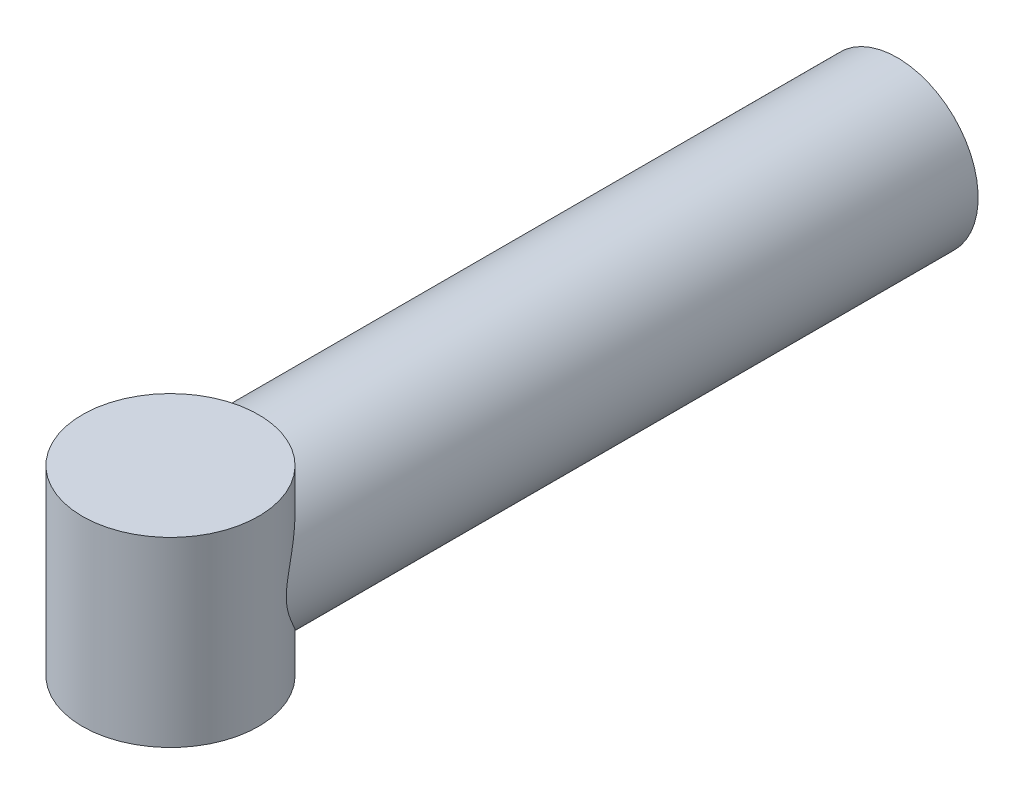
ISO-10303-21;
HEADER;
FILE_DESCRIPTION(('STEP AP214'),'2;1');
FILE_NAME('part.step','',(''),(''),'','','');
FILE_SCHEMA(('AUTOMOTIVE_DESIGN { 1 0 10303 214 1 1 1 1 }'));
ENDSEC;
DATA;
#1=APPLICATION_CONTEXT('core data for automotive mechanical design processes');
#2=APPLICATION_PROTOCOL_DEFINITION('international standard','automotive_design',2000,#1);
#3=PRODUCT_CONTEXT('',#1,'mechanical');
#4=PRODUCT('Part','Part','',(#3));
#5=PRODUCT_RELATED_PRODUCT_CATEGORY('part','',(#4));
#6=PRODUCT_DEFINITION_FORMATION('','',#4);
#7=PRODUCT_DEFINITION_CONTEXT('part definition',#1,'design');
#8=PRODUCT_DEFINITION('design','',#6,#7);
#9=PRODUCT_DEFINITION_SHAPE('','',#8);
#10=(LENGTH_UNIT() NAMED_UNIT(*) SI_UNIT(.MILLI.,.METRE.));
#11=(NAMED_UNIT(*) PLANE_ANGLE_UNIT() SI_UNIT($,.RADIAN.));
#12=(NAMED_UNIT(*) SI_UNIT($,.STERADIAN.) SOLID_ANGLE_UNIT());
#13=UNCERTAINTY_MEASURE_WITH_UNIT(LENGTH_MEASURE(1.E-05),#10,'distance_accuracy_value','');
#14=(GEOMETRIC_REPRESENTATION_CONTEXT(3) GLOBAL_UNCERTAINTY_ASSIGNED_CONTEXT((#13)) GLOBAL_UNIT_ASSIGNED_CONTEXT((#10,
#11,#12)) REPRESENTATION_CONTEXT('',''));
#15=CARTESIAN_POINT('',(0.,0.,0.));
#16=DIRECTION('',(0.,0.,1.));
#17=DIRECTION('',(1.,0.,0.));
#18=AXIS2_PLACEMENT_3D('',#15,#16,#17);
#19=CARTESIAN_POINT('',(0.,22.5,79.7384381673112));
#20=DIRECTION('',(0.,-1.,0.));
#21=DIRECTION('',(0.,0.,-1.));
#22=AXIS2_PLACEMENT_3D('',#19,#20,#21);
#23=CYLINDRICAL_SURFACE('',#22,21.7897785141328);
#24=CARTESIAN_POINT('',(0.,22.5,79.7384381673112));
#25=DIRECTION('',(0.,1.,0.));
#26=DIRECTION('',(0.,0.,1.));
#27=AXIS2_PLACEMENT_3D('',#24,#25,#26);
#28=CIRCLE('',#27,21.7897785141328);
#29=CARTESIAN_POINT('',(0.,22.5,101.528216681444));
#30=VERTEX_POINT('',#29);
#31=EDGE_CURVE('E92',#30,#30,#28,.T.);
#32=ORIENTED_EDGE('',*,*,#31,.F.);
#33=EDGE_LOOP('',(#32));
#34=FACE_BOUND('',#33,.T.);
#35=CARTESIAN_POINT('',(0.,-22.5,79.7384381673112));
#36=DIRECTION('',(0.,1.,0.));
#37=DIRECTION('',(0.,0.,1.));
#38=AXIS2_PLACEMENT_3D('',#35,#36,#37);
#39=CIRCLE('',#38,21.7897785141328);
#40=CARTESIAN_POINT('',(0.,-22.5,101.528216681444));
#41=VERTEX_POINT('',#40);
#42=EDGE_CURVE('E58',#41,#41,#39,.T.);
#43=ORIENTED_EDGE('',*,*,#42,.T.);
#44=EDGE_LOOP('',(#43));
#45=FACE_BOUND('',#44,.T.);
#46=CARTESIAN_POINT('',(-20.,0.,71.0900598398464));
#47=CARTESIAN_POINT('',(-20.0000003572792,-0.28248635995844,71.0900611760895));
#48=CARTESIAN_POINT('',(-19.9939947332945,-0.564967834462663,71.0761325087891));
#49=CARTESIAN_POINT('',(-19.9702133636225,-1.12679786874057,71.0214497676802));
#50=CARTESIAN_POINT('',(-19.9524362772046,-1.40614606795849,70.9806926382015));
#51=CARTESIAN_POINT('',(-19.9056454359633,-1.96035418023474,70.8748581883427));
#52=CARTESIAN_POINT('',(-19.8765852636115,-2.23519059963312,70.8096804431835));
#53=CARTESIAN_POINT('',(-19.8080374855605,-2.77786409045319,70.6586282622042));
#54=CARTESIAN_POINT('',(-19.7685440046747,-3.0456971244569,70.5727421675208));
#55=CARTESIAN_POINT('',(-19.6907617627878,-3.50925755055089,70.4070633814724));
#56=CARTESIAN_POINT('',(-19.6545254750975,-3.70664875964659,70.3308875822483));
#57=CARTESIAN_POINT('',(-19.5768885065106,-4.09695021890429,70.1703741962422));
#58=CARTESIAN_POINT('',(-19.5354895131355,-4.28986190894655,70.0860392784224));
#59=CARTESIAN_POINT('',(-19.4038760259827,-4.86242358702407,69.8226720285174));
#60=CARTESIAN_POINT('',(-19.3062837266498,-5.23567351611419,69.6333614371278));
#61=CARTESIAN_POINT('',(-19.0927621259315,-5.96759739242854,69.2354807974977));
#62=CARTESIAN_POINT('',(-18.9767787807289,-6.32622433661935,69.0268547654054));
#63=CARTESIAN_POINT('',(-18.7276432043651,-7.02954455884812,68.5970045337474));
#64=CARTESIAN_POINT('',(-18.594493853971,-7.37424016209786,68.3757824514976));
#65=CARTESIAN_POINT('',(-18.3241788616531,-8.02097612211901,67.9453182071517));
#66=CARTESIAN_POINT('',(-18.1884326031341,-8.32407754792096,67.7367693122606));
#67=CARTESIAN_POINT('',(-17.9033013564316,-8.92082720114438,67.3154364902626));
#68=CARTESIAN_POINT('',(-17.7539145700074,-9.21447417525667,67.102652007675));
#69=CARTESIAN_POINT('',(-17.4414881495564,-9.79298823916839,66.6747803988144));
#70=CARTESIAN_POINT('',(-17.2784409139607,-10.0778503182388,66.459692049358));
#71=CARTESIAN_POINT('',(-16.9387299103715,-10.6389356480963,66.0289829451423));
#72=CARTESIAN_POINT('',(-16.7620648522505,-10.9151580768854,65.8133621418169));
#73=CARTESIAN_POINT('',(-16.2119545434275,-11.730403788404,65.1684068786787));
#74=CARTESIAN_POINT('',(-15.8179607238608,-12.2568078143143,64.7403770732155));
#75=CARTESIAN_POINT('',(-14.9743114436707,-13.2742707988032,63.8979881856978));
#76=CARTESIAN_POINT('',(-14.5246860889363,-13.7653486491174,63.4836218618771));
#77=CARTESIAN_POINT('',(-13.6891202854943,-14.5897210158038,62.779043335664));
#78=CARTESIAN_POINT('',(-13.3157496671708,-14.9315554610108,62.4838922460962));
#79=CARTESIAN_POINT('',(-12.5367283975626,-15.5913765395692,61.9098375834796));
#80=CARTESIAN_POINT('',(-12.1310780668647,-15.9093634097024,61.6309338491174));
#81=CARTESIAN_POINT('',(-11.2879832649086,-16.5182107715538,61.0937267978679));
#82=CARTESIAN_POINT('',(-10.8505849964875,-16.8091093303085,60.8353946481816));
#83=CARTESIAN_POINT('',(-10.1709008734813,-17.2227501543266,60.4663414288393));
#84=CARTESIAN_POINT('',(-9.94042099926592,-17.3568395330614,60.3464036239859));
#85=CARTESIAN_POINT('',(-9.47162764837507,-17.6170416828864,60.1131668312528));
#86=CARTESIAN_POINT('',(-9.23331218491498,-17.7431524068401,59.9998695477199));
#87=CARTESIAN_POINT('',(-8.60475970769942,-18.0594905657577,59.7151402957496));
#88=CARTESIAN_POINT('',(-8.20861970868929,-18.2431423245337,59.5492985400035));
#89=CARTESIAN_POINT('',(-7.39828948240311,-18.5865248679967,59.2384861816186));
#90=CARTESIAN_POINT('',(-6.98410325143047,-18.7462609143627,59.0935109884143));
#91=CARTESIAN_POINT('',(-6.13942475905216,-19.0396228607865,58.8267677546328));
#92=CARTESIAN_POINT('',(-5.70893763283468,-19.1732569032616,58.7049924772261));
#93=CARTESIAN_POINT('',(-4.83387999030584,-19.4123491767946,58.4868180853634));
#94=CARTESIAN_POINT('',(-4.38930932145478,-19.5178071025585,58.3904192458666));
#95=CARTESIAN_POINT('',(-3.48603665147611,-19.6992674283498,58.2243908126248));
#96=CARTESIAN_POINT('',(-3.02725987452898,-19.7750675433687,58.1549450810515));
#97=CARTESIAN_POINT('',(-2.1020717635314,-19.8946936979974,58.0452891966034));
#98=CARTESIAN_POINT('',(-1.63566040870281,-19.9385196505719,58.0050791233094));
#99=CARTESIAN_POINT('',(-0.699442626089152,-19.9932633538939,57.9548455175677));
#100=CARTESIAN_POINT('',(-0.22963741167008,-20.0041923337382,57.9448116847228));
#101=CARTESIAN_POINT('',(0.709216063219477,-19.9929326169856,57.9551465038911));
#102=CARTESIAN_POINT('',(1.17826438185688,-19.9707465997382,57.9755126962244));
#103=CARTESIAN_POINT('',(2.0616027684016,-19.8978591879361,58.0423770654607));
#104=CARTESIAN_POINT('',(2.47640125457342,-19.8504487278428,58.0858589808239));
#105=CARTESIAN_POINT('',(3.29918613292553,-19.7303874221606,58.1958743269091));
#106=CARTESIAN_POINT('',(3.70717311084469,-19.6577387587078,58.2624057647306));
#107=CARTESIAN_POINT('',(4.51387812578193,-19.4883251122128,58.4173666096859));
#108=CARTESIAN_POINT('',(4.91259539190978,-19.3915581312242,58.5057978309803));
#109=CARTESIAN_POINT('',(5.69862480994007,-19.1752929955066,58.7031261447758));
#110=CARTESIAN_POINT('',(6.08593629004327,-19.0557935049159,58.8120244400071));
#111=CARTESIAN_POINT('',(6.86427751615628,-18.789844023563,59.0539150526225));
#112=CARTESIAN_POINT('',(7.25471359705718,-18.6424355580195,59.1877602148464));
#113=CARTESIAN_POINT('',(8.0197688429527,-18.3263375645778,59.4740701566773));
#114=CARTESIAN_POINT('',(8.39438800957018,-18.1576480388632,59.6265349343738));
#115=CARTESIAN_POINT('',(9.12684589740211,-17.8007496226652,59.9481590894689));
#116=CARTESIAN_POINT('',(9.48468144652722,-17.6125370637604,60.1173216041194));
#117=CARTESIAN_POINT('',(10.182866165579,-17.2183051734186,60.4704127788643));
#118=CARTESIAN_POINT('',(10.5232115852937,-17.0122820482529,60.6543445842856));
#119=CARTESIAN_POINT('',(11.3603997917174,-16.4713053061508,61.1353230142865));
#120=CARTESIAN_POINT('',(11.8453793759681,-16.1255426177975,61.4409723721199));
#121=CARTESIAN_POINT('',(12.773265036337,-15.4009914058984,62.0762023746111));
#122=CARTESIAN_POINT('',(13.2161519258357,-15.0221879712133,62.4057938128865));
#123=CARTESIAN_POINT('',(14.0612795385175,-14.2342939673675,63.0840331419917));
#124=CARTESIAN_POINT('',(14.4634009939412,-13.8251202682369,63.4327325984902));
#125=CARTESIAN_POINT('',(15.2262138066704,-12.9802294400468,64.1426615789099));
#126=CARTESIAN_POINT('',(15.5869129010945,-12.5445172913437,64.5038887463641));
#127=CARTESIAN_POINT('',(16.2762300953977,-11.6368870600109,65.2422280887121));
#128=CARTESIAN_POINT('',(16.6038326994043,-11.1643396230547,65.6195121216801));
#129=CARTESIAN_POINT('',(17.217367306302,-10.1927769991871,66.3745655799328));
#130=CARTESIAN_POINT('',(17.5032811361513,-9.69375039794832,66.7523351449128));
#131=CARTESIAN_POINT('',(17.9004857988479,-8.92498601079619,67.31187902848));
#132=CARTESIAN_POINT('',(18.0274779037477,-8.66567956837124,67.496993481501));
#133=CARTESIAN_POINT('',(18.2710064369723,-8.139677748946,67.8635434673288));
#134=CARTESIAN_POINT('',(18.3875440604192,-7.87298322110109,68.0449794188097));
#135=CARTESIAN_POINT('',(18.6099370782173,-7.33183145867082,68.402259919214));
#136=CARTESIAN_POINT('',(18.7158005929675,-7.05738033161961,68.5781086478247));
#137=CARTESIAN_POINT('',(18.9166591827064,-6.49983071063637,68.9220581501028));
#138=CARTESIAN_POINT('',(19.0116567029901,-6.2167341805159,69.0901606618822));
#139=CARTESIAN_POINT('',(19.1772978028237,-5.68308524466734,69.3919002304823));
#140=CARTESIAN_POINT('',(19.2494712615338,-5.43382809000155,69.5269824044619));
#141=CARTESIAN_POINT('',(19.3851943502404,-4.92776508253637,69.7870468129796));
#142=CARTESIAN_POINT('',(19.4487440979395,-4.67095933282386,69.9120291853577));
#143=CARTESIAN_POINT('',(19.5666038958633,-4.14962007147203,70.1488637407674));
#144=CARTESIAN_POINT('',(19.6209246713158,-3.88509595448173,70.2607311175386));
#145=CARTESIAN_POINT('',(19.7196999801292,-3.34783236365247,70.4679974996239));
#146=CARTESIAN_POINT('',(19.7641563150871,-3.07509440030461,70.5633995113901));
#147=CARTESIAN_POINT('',(19.835543689033,-2.56991465698943,70.7189224476781));
#148=CARTESIAN_POINT('',(19.8641782197508,-2.33872009183261,70.782293940923));
#149=CARTESIAN_POINT('',(19.91361222915,-1.8716702733388,70.8927516503787));
#150=CARTESIAN_POINT('',(19.9344141773357,-1.63581651370543,70.9398429991088));
#151=CARTESIAN_POINT('',(19.9676888311595,-1.1609987762512,71.0156188315472));
#152=CARTESIAN_POINT('',(19.9801769000767,-0.922041371792785,71.0443372628492));
#153=CARTESIAN_POINT('',(19.9965496539802,-0.442265787116113,71.0820599746344));
#154=CARTESIAN_POINT('',(20.0004346514609,-0.201447674804308,71.0910649711802));
#155=CARTESIAN_POINT('',(19.9994868890063,0.280675900510312,71.0888732663462));
#156=CARTESIAN_POINT('',(19.9946324871611,0.521981091178815,71.0776264140584));
#157=CARTESIAN_POINT('',(19.9763059050874,1.00251359399952,71.0354405772472));
#158=CARTESIAN_POINT('',(19.9628333922811,1.24174082560094,71.0045008327638));
#159=CARTESIAN_POINT('',(19.9275962101371,1.71691197309894,70.9244007797162));
#160=CARTESIAN_POINT('',(19.9058165438277,1.95284914619686,70.8752075223255));
#161=CARTESIAN_POINT('',(19.8544476126255,2.41995250095189,70.7607275529592));
#162=CARTESIAN_POINT('',(19.8248552400749,2.65111674454339,70.6954344376318));
#163=CARTESIAN_POINT('',(19.7389528416094,3.241529531484,70.5089218431146));
#164=CARTESIAN_POINT('',(19.6771344800041,3.59670107341507,70.3773154639281));
#165=CARTESIAN_POINT('',(19.5370469769259,4.29303738735554,70.0883598687633));
#166=CARTESIAN_POINT('',(19.4587659314387,4.63419180916719,69.9309920432674));
#167=CARTESIAN_POINT('',(19.2868375591216,5.30453102851535,69.5970497005369));
#168=CARTESIAN_POINT('',(19.1931332729075,5.63366571286817,69.4204048386497));
#169=CARTESIAN_POINT('',(18.9915317392251,6.27982906877321,69.0538728785239));
#170=CARTESIAN_POINT('',(18.8836366240762,6.59685954989148,68.8639877717798));
#171=CARTESIAN_POINT('',(18.6567744814889,7.21319436939717,68.4793089028174));
#172=CARTESIAN_POINT('',(18.5381058524331,7.51273585053304,68.2847172139081));
#173=CARTESIAN_POINT('',(18.2880490085117,8.1024592546616,67.8895389036377));
#174=CARTESIAN_POINT('',(18.1566586541723,8.39263959236797,67.6889512778459));
#175=CARTESIAN_POINT('',(17.8812449450892,8.96447722482946,67.2838989594852));
#176=CARTESIAN_POINT('',(17.7372135928139,9.24612897007442,67.079431877564));
#177=CARTESIAN_POINT('',(17.4366330883591,9.80119392963664,66.6685054884422));
#178=CARTESIAN_POINT('',(17.2800826489563,10.0746062927839,66.4620459783025));
#179=CARTESIAN_POINT('',(16.7917573383597,10.882707127326,65.8421178406379));
#180=CARTESIAN_POINT('',(16.4411515991456,11.4055843065955,65.4278652863788));
#181=CARTESIAN_POINT('',(15.6892206203267,12.4195952593169,64.6072554692453));
#182=CARTESIAN_POINT('',(15.2879199372172,12.910744228893,64.200894492935));
#183=CARTESIAN_POINT('',(14.5078388719998,13.7768037286288,63.4734518695891));
#184=CARTESIAN_POINT('',(14.13733066117,14.1570505792372,63.14985424267));
#185=CARTESIAN_POINT('',(13.3602314126824,14.892632379426,62.5178240715015));
#186=CARTESIAN_POINT('',(12.9536384316519,15.2479659854376,62.209392345415));
#187=CARTESIAN_POINT('',(12.1046768836881,15.930244914601,61.6127700580446));
#188=CARTESIAN_POINT('',(11.6623703386561,16.2572374916575,61.3245459635045));
#189=CARTESIAN_POINT('',(10.9720303193811,16.7239857301829,60.9107725089728));
#190=CARTESIAN_POINT('',(10.7374554735786,16.8756012652948,60.775951183973));
#191=CARTESIAN_POINT('',(10.2593245829736,17.1704737986945,60.5130603499061));
#192=CARTESIAN_POINT('',(10.0157663139267,17.3137287039564,60.3849925323003));
#193=CARTESIAN_POINT('',(9.38524365377179,17.6666167662132,60.0687978769084));
#194=CARTESIAN_POINT('',(8.99219360998417,17.8700761405912,59.8858007069753));
#195=CARTESIAN_POINT('',(8.186235509903,18.2533452503572,59.5401160415693));
#196=CARTESIAN_POINT('',(7.77333215133454,18.4331605432046,59.3774237739584));
#197=CARTESIAN_POINT('',(6.92913060676511,18.7668070500378,59.0748821213027));
#198=CARTESIAN_POINT('',(6.49783715271052,18.9206448983334,58.935026904267));
#199=CARTESIAN_POINT('',(5.61886605752035,19.2000253910914,58.6806108665613));
#200=CARTESIAN_POINT('',(5.17118820030012,19.325567662223,58.5660503796294));
#201=CARTESIAN_POINT('',(4.25868703321097,19.5470122082805,58.3637313842014));
#202=CARTESIAN_POINT('',(3.79375684931506,19.6426744812833,58.2761899613456));
#203=CARTESIAN_POINT('',(2.85367547428726,19.8011037797231,58.1310980970539));
#204=CARTESIAN_POINT('',(2.37852425422598,19.8638707120411,58.0735477405157));
#205=CARTESIAN_POINT('',(1.4224353310332,19.9551286011376,57.9898456990057));
#206=CARTESIAN_POINT('',(0.941500821485025,19.9836376699871,57.9636774223992));
#207=CARTESIAN_POINT('',(-0.0218212092103692,20.005788300199,57.9433471772745));
#208=CARTESIAN_POINT('',(-0.504208568186972,19.9994336187627,57.9491817598677));
#209=CARTESIAN_POINT('',(-1.40709908668984,19.9549193279786,57.9900314933659));
#210=CARTESIAN_POINT('',(-1.82797388316128,19.9207335357678,58.0214006603827));
#211=CARTESIAN_POINT('',(-2.66424332886874,19.8262158380741,58.1080677320468));
#212=CARTESIAN_POINT('',(-3.07963851330049,19.7658865058179,58.1633632816945));
#213=CARTESIAN_POINT('',(-3.90223646601112,19.620068120257,58.2968742652014));
#214=CARTESIAN_POINT('',(-4.30943885313428,19.5345778992638,58.3750907627953));
#215=CARTESIAN_POINT('',(-5.11326928763226,19.3397397320065,58.5531033116574));
#216=CARTESIAN_POINT('',(-5.5098967741772,19.2303905232165,58.6529005048905));
#217=CARTESIAN_POINT('',(-6.29852849405549,18.98689826423,58.8747332619868));
#218=CARTESIAN_POINT('',(-6.69027482841141,18.8522963712543,58.9971796660797));
#219=CARTESIAN_POINT('',(-7.45904300774888,18.5615620874849,59.2610771434985));
#220=CARTESIAN_POINT('',(-7.83606510566264,18.4054300667435,59.4025278901832));
#221=CARTESIAN_POINT('',(-8.57429760167227,18.0733308207,59.7026035402509));
#222=CARTESIAN_POINT('',(-8.93550394705475,17.8973585522466,59.8612328098002));
#223=CARTESIAN_POINT('',(-9.641232095497,17.5272780447933,60.1937883069976));
#224=CARTESIAN_POINT('',(-9.98575033965209,17.3331659629257,60.3677177754892));
#225=CARTESIAN_POINT('',(-10.8262977303207,16.8267141025745,60.819825061821));
#226=CARTESIAN_POINT('',(-11.3115366040743,16.503952388982,61.1064942120083));
#227=CARTESIAN_POINT('',(-12.2424452562332,15.8257543642277,61.7044888496532));
#228=CARTESIAN_POINT('',(-12.6880979931938,15.4703041137017,62.0158248478785));
#229=CARTESIAN_POINT('',(-13.5407693430654,14.729803830266,62.6584034521194));
#230=CARTESIAN_POINT('',(-13.9476997342337,14.3446896599089,62.9896888339062));
#231=CARTESIAN_POINT('',(-14.7222974190903,13.5485221167601,63.6663244098141));
#232=CARTESIAN_POINT('',(-15.0899704020456,13.1374725163599,64.0116725558814));
#233=CARTESIAN_POINT('',(-15.7951426190903,12.2812207042018,64.7196721216929));
#234=CARTESIAN_POINT('',(-16.1317210162458,11.8354402044192,65.0825396346472));
#235=CARTESIAN_POINT('',(-16.765420585543,10.9192972032391,65.811896894606));
#236=CARTESIAN_POINT('',(-17.0625315490443,10.448928385504,66.1783875525367));
#237=CARTESIAN_POINT('',(-17.6172638797565,9.48375304714811,66.9073997274666));
#238=CARTESIAN_POINT('',(-17.8749453566086,8.98898527631192,67.269926487795));
#239=CARTESIAN_POINT('',(-18.2319738499236,8.22640259138612,67.8038007391237));
#240=CARTESIAN_POINT('',(-18.3460519270311,7.96884578037025,67.9800789253475));
#241=CARTESIAN_POINT('',(-18.5642735484756,7.44633742606715,68.3277304426973));
#242=CARTESIAN_POINT('',(-18.6684183744524,7.18138684248035,68.4991044045892));
#243=CARTESIAN_POINT('',(-18.8689020499327,6.63706536769014,68.838951110321));
#244=CARTESIAN_POINT('',(-18.9649979819889,6.35750162080035,69.0072593390071));
#245=CARTESIAN_POINT('',(-19.1461392083139,5.78915314843404,69.3338886451562));
#246=CARTESIAN_POINT('',(-19.2311870838856,5.50037059658231,69.4922120510409));
#247=CARTESIAN_POINT('',(-19.3896570858591,4.91262107808144,69.7953555684276));
#248=CARTESIAN_POINT('',(-19.4630789026105,4.6136538404292,69.9401753202286));
#249=CARTESIAN_POINT('',(-19.5974170804695,4.0047946039629,70.2117056863148));
#250=CARTESIAN_POINT('',(-19.6583352928504,3.69490423039188,70.3384189805817));
#251=CARTESIAN_POINT('',(-19.7585521354798,3.1103293068833,70.5511737944867));
#252=CARTESIAN_POINT('',(-19.7997117336784,2.83715498387932,70.6404552430335));
#253=CARTESIAN_POINT('',(-19.8711863892135,2.28337645299683,70.7976397322475));
#254=CARTESIAN_POINT('',(-19.9015068985801,2.00277605691477,70.8655535187199));
#255=CARTESIAN_POINT('',(-19.9503360214293,1.43679047119892,70.9758923891488));
#256=CARTESIAN_POINT('',(-19.9688959543561,1.15143172568808,71.0184281665216));
#257=CARTESIAN_POINT('',(-19.9937267120661,0.577379900876563,71.0755088197463));
#258=CARTESIAN_POINT('',(-19.999999634878,0.288687399290344,71.0900584742706));
#259=CARTESIAN_POINT('',(-20.,0.,71.0900598398464));
#260=B_SPLINE_CURVE_WITH_KNOTS('',3,(#46,#47,#48,#49,#50,#51,#52,#53,#54,#55,#56,#57,#58,#59,
#60,#61,#62,#63,#64,#65,#66,#67,#68,#69,#70,#71,#72,#73,#74,#75,#76,#77,#78,#79,#80,#81,#82,#83,
#84,#85,#86,#87,#88,#89,#90,#91,#92,#93,#94,#95,#96,#97,#98,#99,#100,#101,#102,#103,#104,#105,
#106,#107,#108,#109,#110,#111,#112,#113,#114,#115,#116,#117,#118,#119,#120,#121,#122,#123,#124,
#125,#126,#127,#128,#129,#130,#131,#132,#133,#134,#135,#136,#137,#138,#139,#140,#141,#142,#143,
#144,#145,#146,#147,#148,#149,#150,#151,#152,#153,#154,#155,#156,#157,#158,#159,#160,#161,#162,
#163,#164,#165,#166,#167,#168,#169,#170,#171,#172,#173,#174,#175,#176,#177,#178,#179,#180,#181,
#182,#183,#184,#185,#186,#187,#188,#189,#190,#191,#192,#193,#194,#195,#196,#197,#198,#199,#200,
#201,#202,#203,#204,#205,#206,#207,#208,#209,#210,#211,#212,#213,#214,#215,#216,#217,#218,#219,
#220,#221,#222,#223,#224,#225,#226,#227,#228,#229,#230,#231,#232,#233,#234,#235,#236,#237,#238,
#239,#240,#241,#242,#243,#244,#245,#246,#247,#248,#249,#250,#251,#252,#253,#254,#255,#256,#257,
#258,#259),.UNSPECIFIED.,.T.,.F.,(4,2,2,2,2,2,2,2,2,2,2,2,2,2,2,2,2,2,2,2,2,2,2,2,2,2,2,2,2,2,2,
2,2,2,2,2,2,2,2,2,2,2,2,2,2,2,2,2,2,2,2,2,2,2,2,2,2,2,2,2,2,2,2,2,2,2,2,2,2,2,2,2,2,2,2,2,2,2,2,
2,2,2,2,2,2,2,2,2,2,2,2,2,2,2,2,2,2,2,2,2,2,2,2,2,2,2,4),(0.,0.847061951426545,1.69422039700871,
2.54490154196973,3.39606274591446,4.03976964706402,4.68326669006242,5.97099261850597,
7.26257527894536,8.55394146984323,9.73003835955019,10.9062905194306,12.0832016266586,
13.2602243696371,15.611000827189,17.9605106437044,19.7170016540209,21.4734752218796,
23.2274419522324,24.1043339654017,24.9814500636822,26.3812529618232,27.7807474363319,
29.1798046443653,30.5788770108573,31.9873321804388,33.395791183888,34.8037693675039,
36.2116336371393,37.4694584047576,38.7271744458596,39.9849947100211,41.2428889120458,
42.5564374522148,43.8699858576101,45.1837815303204,46.4978577400449,48.5032384839807,
50.5095289766565,52.5215294423595,54.5331534811019,56.5945869875509,58.6569164481209,
59.6856467510954,60.7142593027346,61.7420833309049,62.7696755994726,63.6469894527702,
64.5242913306506,65.4005665940428,66.2766816864855,67.0003313221939,67.7237526098081,
68.445833343568,69.1678878483334,69.891732881106,70.6156058491646,71.3407918641609,
72.0662667719239,73.2156146290938,74.3657964443101,75.520325429202,76.6746811318953,
77.8034518542551,78.9324127382224,80.06209309852,81.1918897632304,83.4501959465387,
85.7074123771041,87.5710854550738,89.4348589635513,91.2954626350188,92.2256255060946,
93.1560202469021,94.5913961068917,96.0264339813782,97.4611048092916,98.8957945650927,
100.341728104621,101.787665737227,103.232838568379,104.677855659011,105.94662256329,
107.215264615173,108.483965552592,109.75273364107,111.047294474389,112.341833060014,
113.636701446737,114.931844772185,116.877341685308,118.823672097468,120.774335709062,
122.724716241543,124.721288044638,126.718375279247,128.712386984433,129.709075836354,
130.705635915846,131.725768989794,132.745663286277,133.765584742237,134.785355080368,
135.655418929428,136.525044521076,137.390848723369,138.25650507517),.UNSPECIFIED.);
#261=CARTESIAN_POINT('',(-20.,0.,71.0900598398464));
#262=VERTEX_POINT('',#261);
#263=EDGE_CURVE('E10',#262,#262,#260,.T.);
#264=ORIENTED_EDGE('',*,*,#263,.T.);
#265=EDGE_LOOP('',(#264));
#266=FACE_BOUND('',#265,.T.);
#267=ADVANCED_FACE('F34',(#34,#45,#266),#23,.T.);
#268=CARTESIAN_POINT('',(0.,22.5,79.7384381673112));
#269=DIRECTION('',(0.,1.,0.));
#270=DIRECTION('',(0.,0.,1.));
#271=AXIS2_PLACEMENT_3D('',#268,#269,#270);
#272=PLANE('',#271);
#273=ORIENTED_EDGE('',*,*,#31,.T.);
#274=EDGE_LOOP('',(#273));
#275=FACE_BOUND('',#274,.T.);
#276=ADVANCED_FACE('F83',(#275),#272,.T.);
#277=CARTESIAN_POINT('',(0.,-22.5,79.7384381673112));
#278=DIRECTION('',(0.,1.,0.));
#279=DIRECTION('',(0.,0.,1.));
#280=AXIS2_PLACEMENT_3D('',#277,#278,#279);
#281=PLANE('',#280);
#282=ORIENTED_EDGE('',*,*,#42,.F.);
#283=EDGE_LOOP('',(#282));
#284=FACE_BOUND('',#283,.T.);
#285=ADVANCED_FACE('F67',(#284),#281,.F.);
#286=CARTESIAN_POINT('',(0.,0.,80.));
#287=DIRECTION('',(0.,0.,-1.));
#288=DIRECTION('',(-1.,0.,0.));
#289=AXIS2_PLACEMENT_3D('',#286,#287,#288);
#290=CYLINDRICAL_SURFACE('',#289,20.);
#291=CARTESIAN_POINT('',(0.,0.,-100.));
#292=DIRECTION('',(0.,0.,-1.));
#293=DIRECTION('',(-1.,0.,0.));
#294=AXIS2_PLACEMENT_3D('',#291,#292,#293);
#295=CIRCLE('',#294,20.);
#296=CARTESIAN_POINT('',(-20.,0.,-100.));
#297=VERTEX_POINT('',#296);
#298=EDGE_CURVE('E47',#297,#297,#295,.T.);
#299=ORIENTED_EDGE('',*,*,#298,.F.);
#300=EDGE_LOOP('',(#299));
#301=FACE_BOUND('',#300,.T.);
#302=ORIENTED_EDGE('',*,*,#263,.F.);
#303=EDGE_LOOP('',(#302));
#304=FACE_BOUND('',#303,.T.);
#305=ADVANCED_FACE('F36',(#301,#304),#290,.T.);
#306=CARTESIAN_POINT('',(0.,0.,80.));
#307=DIRECTION('',(0.,0.,-1.));
#308=DIRECTION('',(-1.,0.,0.));
#309=AXIS2_PLACEMENT_3D('',#306,#307,#308);
#310=CYLINDRICAL_SURFACE('',#309,15.);
#311=CARTESIAN_POINT('',(0.,0.,-100.));
#312=DIRECTION('',(0.,0.,-1.));
#313=DIRECTION('',(-1.,0.,0.));
#314=AXIS2_PLACEMENT_3D('',#311,#312,#313);
#315=CIRCLE('',#314,15.);
#316=CARTESIAN_POINT('',(-15.,0.,-100.));
#317=VERTEX_POINT('',#316);
#318=EDGE_CURVE('E52',#317,#317,#315,.T.);
#319=ORIENTED_EDGE('',*,*,#318,.T.);
#320=EDGE_LOOP('',(#319));
#321=FACE_BOUND('',#320,.T.);
#322=CARTESIAN_POINT('',(-15.,0.,63.9335513377587));
#323=CARTESIAN_POINT('',(-14.9999965125222,-0.362177097061445,63.933545087432));
#324=CARTESIAN_POINT('',(-14.9868527580879,-0.724405802017627,63.9210416143776));
#325=CARTESIAN_POINT('',(-14.9345819629865,-1.44532788372272,63.8716819780383));
#326=CARTESIAN_POINT('',(-14.8954494567292,-1.80402050070439,63.8348206921677));
#327=CARTESIAN_POINT('',(-14.7919937530774,-2.51520582213886,63.7385526002777));
#328=CARTESIAN_POINT('',(-14.7276320143901,-2.86768817452836,63.6791113043512));
#329=CARTESIAN_POINT('',(-14.5749070844514,-3.5635793877466,63.5403783848185));
#330=CARTESIAN_POINT('',(-14.4865298835007,-3.90698282357194,63.4610751766565));
#331=CARTESIAN_POINT('',(-14.2882408596077,-4.57903996400495,63.2867565313099));
#332=CARTESIAN_POINT('',(-14.1785741778342,-4.90781361419552,63.1919217152761));
#333=CARTESIAN_POINT('',(-13.9384178413728,-5.55329339187417,62.9891207869689));
#334=CARTESIAN_POINT('',(-13.8079353929933,-5.87000364881113,62.8811592221718));
#335=CARTESIAN_POINT('',(-13.527220521727,-6.49079127389133,62.6550771376933));
#336=CARTESIAN_POINT('',(-13.3769861643358,-6.79486740080248,62.5369556233377));
#337=CARTESIAN_POINT('',(-13.057699526354,-7.38989175952804,62.2933453651144));
#338=CARTESIAN_POINT('',(-12.8886459323197,-7.68083907305426,62.1678561073219));
#339=CARTESIAN_POINT('',(-12.5025144043006,-8.29702556405656,61.8905487958121));
#340=CARTESIAN_POINT('',(-12.282140697781,-8.61980723449827,61.737851021262));
#341=CARTESIAN_POINT('',(-11.8176593423237,-9.24635178276289,61.4295578315096));
#342=CARTESIAN_POINT('',(-11.5735499608615,-9.55011326959202,61.2739622054573));
#343=CARTESIAN_POINT('',(-11.0620433186142,-10.1382060348609,60.9630469467649));
#344=CARTESIAN_POINT('',(-10.7946205147857,-10.4225153765743,60.8077278120303));
#345=CARTESIAN_POINT('',(-10.2373603312507,-10.9703755382432,60.5006592614612));
#346=CARTESIAN_POINT('',(-9.94752147790624,-11.2339249911344,60.3489100811734));
#347=CARTESIAN_POINT('',(-9.29824453243025,-11.7792099775317,60.028335698618));
#348=CARTESIAN_POINT('',(-8.93506692874337,-12.0571761905864,59.8606308835689));
#349=CARTESIAN_POINT('',(-8.18071236508024,-12.5812105089892,59.538472434733));
#350=CARTESIAN_POINT('',(-7.78953049977268,-12.8272730046385,59.3840211329498));
#351=CARTESIAN_POINT('',(-6.98167482357663,-13.2842473240543,59.092985878046));
#352=CARTESIAN_POINT('',(-6.56504182944589,-13.4952135093358,58.9563743643855));
#353=CARTESIAN_POINT('',(-5.70844261967422,-13.8792559768513,58.7049621501485));
#354=CARTESIAN_POINT('',(-5.26848620570321,-14.0523480213254,58.5901523788883));
#355=CARTESIAN_POINT('',(-4.48678312574707,-14.3175326535649,58.4128849100989));
#356=CARTESIAN_POINT('',(-4.149495437688,-14.4189661328754,58.3445913559355));
#357=CARTESIAN_POINT('',(-3.46605943890999,-14.598327399621,58.2232985686367));
#358=CARTESIAN_POINT('',(-3.11991296187235,-14.6762600094887,58.170296197812));
#359=CARTESIAN_POINT('',(-2.42111432717048,-14.8075833058341,58.0807220487224));
#360=CARTESIAN_POINT('',(-2.06846630542592,-14.8609890702425,58.0441401762347));
#361=CARTESIAN_POINT('',(-1.35888749740999,-14.9425886664913,57.9881618517001));
#362=CARTESIAN_POINT('',(-1.00195656811692,-14.9707816539985,57.9687659751835));
#363=CARTESIAN_POINT('',(-0.285818342096618,-15.0015662052067,57.947584341385));
#364=CARTESIAN_POINT('',(0.0733919057876555,-15.0041113308271,57.9458305268735));
#365=CARTESIAN_POINT('',(0.790713463877849,-14.9834414521212,57.9600564605931));
#366=CARTESIAN_POINT('',(1.14882477817339,-14.9602265437764,57.9760361427495));
#367=CARTESIAN_POINT('',(1.86135426432248,-14.8883717846132,58.0253687972915));
#368=CARTESIAN_POINT('',(2.21577153291349,-14.8397258576007,58.0587259216359));
#369=CARTESIAN_POINT('',(2.91831835045712,-14.7176948869371,58.1420725887474));
#370=CARTESIAN_POINT('',(3.26644788518655,-14.644309787332,58.1920621691331));
#371=CARTESIAN_POINT('',(3.94713601046372,-14.4755160890388,58.3064236883939));
#372=CARTESIAN_POINT('',(4.27986743047115,-14.3805884162112,58.3704806971417));
#373=CARTESIAN_POINT('',(4.93532625657492,-14.1690211312056,58.5122881096808));
#374=CARTESIAN_POINT('',(5.2580538672184,-14.0523819633028,58.5900382332726));
#375=CARTESIAN_POINT('',(5.89202157794062,-13.7985752478774,58.7578266204953));
#376=CARTESIAN_POINT('',(6.20326136212052,-13.6614071363616,58.8478652217224));
#377=CARTESIAN_POINT('',(6.81307835821208,-13.3677419492456,59.0387154771064));
#378=CARTESIAN_POINT('',(7.11165388861024,-13.2112423176021,59.1395285556433));
#379=CARTESIAN_POINT('',(7.72801561554848,-12.8614566912527,59.3621941462313));
#380=CARTESIAN_POINT('',(8.04418341865345,-12.6660129047011,59.485137653418));
#381=CARTESIAN_POINT('',(8.65866766411191,-12.254154946079,59.7401231050521));
#382=CARTESIAN_POINT('',(8.95698296974874,-12.0377394409756,59.8721656277091));
#383=CARTESIAN_POINT('',(9.5353023705513,-11.5850331106768,60.1431702682722));
#384=CARTESIAN_POINT('',(9.81528843109959,-11.3487232182256,60.2821389711453));
#385=CARTESIAN_POINT('',(10.3560589863252,-10.8575088657946,60.5645091199271));
#386=CARTESIAN_POINT('',(10.6168419548133,-10.6026029310696,60.7079109168782));
#387=CARTESIAN_POINT('',(11.1622437656266,-10.0293000766598,61.0217572188455));
#388=CARTESIAN_POINT('',(11.4431454683559,-9.70756165327734,61.192576061569));
#389=CARTESIAN_POINT('',(11.976927266968,-9.04077675541374,61.5327290975183));
#390=CARTESIAN_POINT('',(12.2298017307971,-8.69572561860109,61.7020629860708));
#391=CARTESIAN_POINT('',(12.7063243855136,-7.98329156820444,62.0345362777091));
#392=CARTESIAN_POINT('',(12.9299797320171,-7.61591415462598,62.1976771904548));
#393=CARTESIAN_POINT('',(13.3466314357605,-6.85957221339418,62.5125844636304));
#394=CARTESIAN_POINT('',(13.539637182061,-6.47061434605915,62.6643542998706));
#395=CARTESIAN_POINT('',(13.8515304768053,-5.76598936380867,62.9170274038461));
#396=CARTESIAN_POINT('',(13.9771763418471,-5.45458385434984,63.0215019412016));
#397=CARTESIAN_POINT('',(14.2083396413119,-4.82046791125307,63.2175272978719));
#398=CARTESIAN_POINT('',(14.3138622275757,-4.49776039619624,63.3090814234282));
#399=CARTESIAN_POINT('',(14.5034713726243,-3.84258039451478,63.47621992765));
#400=CARTESIAN_POINT('',(14.587589984697,-3.51012335091336,63.5518281565078));
#401=CARTESIAN_POINT('',(14.7333718641886,-2.83662355260294,63.6844063258352));
#402=CARTESIAN_POINT('',(14.79503537495,-2.49558089097779,63.7413764682823));
#403=CARTESIAN_POINT('',(14.8952612527898,-1.80398838207816,63.834652259931));
#404=CARTESIAN_POINT('',(14.9336040262129,-1.45337969066661,63.8707613218566));
#405=CARTESIAN_POINT('',(14.9854676828041,-0.748698435212735,63.9197308869884));
#406=CARTESIAN_POINT('',(14.9989892240886,-0.394625963260215,63.9325920065961));
#407=CARTESIAN_POINT('',(15.0009013775918,0.313608141820198,63.9344068422259));
#408=CARTESIAN_POINT('',(14.9892946863811,0.667769761303391,63.9233631235333));
#409=CARTESIAN_POINT('',(14.9412214676107,1.37286806944612,63.8779391248485));
#410=CARTESIAN_POINT('',(14.9047556792789,1.7238048536872,63.8435595387887));
#411=CARTESIAN_POINT('',(14.8138157918995,2.37600151972481,63.7588068316491));
#412=CARTESIAN_POINT('',(14.7621574128258,2.6779947675419,63.7109654632995));
#413=CARTESIAN_POINT('',(14.6411295390271,3.27571974020924,63.600331329892));
#414=CARTESIAN_POINT('',(14.5717536365582,3.57144915768097,63.5375331560903));
#415=CARTESIAN_POINT('',(14.4160932776062,4.15543451706225,63.3988680430605));
#416=CARTESIAN_POINT('',(14.3298000291336,4.44368648434115,63.3229943109208));
#417=CARTESIAN_POINT('',(14.1411558970226,5.01171771992063,63.1602090024189));
#418=CARTESIAN_POINT('',(14.0388013729254,5.29149505016069,63.0732949244979));
#419=CARTESIAN_POINT('',(13.7680064317016,5.96906287929053,62.8482009034064));
#420=CARTESIAN_POINT('',(13.5908732168564,6.36169850673823,62.7048791866156));
#421=CARTESIAN_POINT('',(13.2060093770567,7.12633631462007,62.4047907726763));
#422=CARTESIAN_POINT('',(12.9982669422316,7.49833045440359,62.2480188958859));
#423=CARTESIAN_POINT('',(12.5534443496832,8.2214039729057,61.9260552691484));
#424=CARTESIAN_POINT('',(12.316317242895,8.5724485187968,61.7608502995055));
#425=CARTESIAN_POINT('',(11.8142222283828,9.25217110766371,61.4269800898103));
#426=CARTESIAN_POINT('',(11.5492574463352,9.58085165490559,61.2583152399489));
#427=CARTESIAN_POINT('',(10.9878898554861,10.220083611898,60.9190328142018));
#428=CARTESIAN_POINT('',(10.6910488681638,10.5302570573842,60.7484276267231));
#429=CARTESIAN_POINT('',(10.0703708037446,11.12530696679,60.4121174118163));
#430=CARTESIAN_POINT('',(9.74653173358854,11.4101815598796,60.2464127473814));
#431=CARTESIAN_POINT('',(9.07324515113072,11.9525237281391,59.9240545802716));
#432=CARTESIAN_POINT('',(8.72383265826235,12.2100276405891,59.7673892067181));
#433=CARTESIAN_POINT('',(8.00022113758255,12.6959159205349,59.4666763979639));
#434=CARTESIAN_POINT('',(7.6260271836045,12.924306221006,59.3226263937938));
#435=CARTESIAN_POINT('',(6.92010734673068,13.3133684120658,59.073931348073));
#436=CARTESIAN_POINT('',(6.59197519522505,13.4789520583277,58.9667504061657));
#437=CARTESIAN_POINT('',(5.92107514087102,13.7868428375602,58.7656489034918));
#438=CARTESIAN_POINT('',(5.57830991818568,13.9291542101626,58.6717259278796));
#439=CARTESIAN_POINT('',(4.87990818715323,14.1889124749518,58.4990815168762));
#440=CARTESIAN_POINT('',(4.52427695725066,14.3063694315123,58.4203539295096));
#441=CARTESIAN_POINT('',(3.80209456792883,14.5150034924922,58.2797842404921));
#442=CARTESIAN_POINT('',(3.4355432907461,14.6061803133893,58.2179423210121));
#443=CARTESIAN_POINT('',(2.6920746000054,14.7613579362769,58.1123224028787));
#444=CARTESIAN_POINT('',(2.31511244770029,14.8252117328333,58.0686421537798));
#445=CARTESIAN_POINT('',(1.5556556932391,14.924026139743,58.000919765193));
#446=CARTESIAN_POINT('',(1.17316107559548,14.9589866691969,57.9768776806908));
#447=CARTESIAN_POINT('',(0.405964250491747,14.999423889912,57.9490611895205));
#448=CARTESIAN_POINT('',(0.0212625630932589,15.0049072626633,57.9452821898861));
#449=CARTESIAN_POINT('',(-0.747068269622803,14.9863115534984,57.9580815842463));
#450=CARTESIAN_POINT('',(-1.13069748140948,14.9622343462896,57.9746586872738));
#451=CARTESIAN_POINT('',(-1.85999054767516,14.8883421104054,58.0253882276845));
#452=CARTESIAN_POINT('',(-2.20602412106725,14.8409788775813,58.0578653797504));
#453=CARTESIAN_POINT('',(-2.89212091557999,14.7226629343946,58.1386839232183));
#454=CARTESIAN_POINT('',(-3.23218455166133,14.6517118704737,58.1870242073633));
#455=CARTESIAN_POINT('',(-3.9042982133844,14.4871044020517,58.2985924976303));
#456=CARTESIAN_POINT('',(-4.2363472827052,14.3934453025463,58.3618222708208));
#457=CARTESIAN_POINT('',(-4.89060001875089,14.1844978172506,58.5019501667779));
#458=CARTESIAN_POINT('',(-5.21280318252383,14.06920832867,58.5788489864281));
#459=CARTESIAN_POINT('',(-5.85973468225725,13.812669808477,58.7485682536711));
#460=CARTESIAN_POINT('',(-6.18395456655916,13.6705043533194,58.841938873778));
#461=CARTESIAN_POINT('',(-6.81865370479577,13.3652530457725,59.0403468399189));
#462=CARTESIAN_POINT('',(-7.12913272510645,13.2021668378693,59.1453843842091));
#463=CARTESIAN_POINT('',(-7.73531379915245,12.8563870271688,59.3653349371132));
#464=CARTESIAN_POINT('',(-8.03101521246296,12.6736925756769,59.4802483731379));
#465=CARTESIAN_POINT('',(-8.60685316251048,12.2899076443082,59.7181085407925));
#466=CARTESIAN_POINT('',(-8.88698783894372,12.0888149733179,59.8410562287522));
#467=CARTESIAN_POINT('',(-9.47388849447768,11.6363013370332,60.1129377458304));
#468=CARTESIAN_POINT('',(-9.77790745064882,11.3819404091031,60.2629160997257));
#469=CARTESIAN_POINT('',(-10.3634983745702,10.8514527505307,60.5681123056644));
#470=CARTESIAN_POINT('',(-10.6450682781031,10.5753240229451,60.7233306376666));
#471=CARTESIAN_POINT('',(-11.1856636505549,10.0018269984095,61.0362163295919));
#472=CARTESIAN_POINT('',(-11.4446401027022,9.70441495089044,61.1938881806025));
#473=CARTESIAN_POINT('',(-11.938681995137,9.08973966351759,61.5080233212556));
#474=CARTESIAN_POINT('',(-12.1737462712196,8.77247545834132,61.6644865517119));
#475=CARTESIAN_POINT('',(-12.6510931768931,8.07182837581895,61.9947037559379));
#476=CARTESIAN_POINT('',(-12.8895723832791,7.68549013745132,62.1677175922445));
#477=CARTESIAN_POINT('',(-13.3325368315754,6.88849313179706,62.5014185221139));
#478=CARTESIAN_POINT('',(-13.537012175264,6.47782732998818,62.6621020191197));
#479=CARTESIAN_POINT('',(-13.9090114154824,5.63480207944298,62.9637244009461));
#480=CARTESIAN_POINT('',(-14.0766524104201,5.20251690260923,63.1047253206815));
#481=CARTESIAN_POINT('',(-14.3728440120265,4.31726008775133,63.3599722920262));
#482=CARTESIAN_POINT('',(-14.501426740808,3.86430580291769,63.474240311306));
#483=CARTESIAN_POINT('',(-14.6729835435301,3.12784883984571,63.6292664200639));
#484=CARTESIAN_POINT('',(-14.7295616423144,2.84976450877506,63.6810771826841));
#485=CARTESIAN_POINT('',(-14.8270949323251,2.28872283314869,63.7710923940985));
#486=CARTESIAN_POINT('',(-14.8680542983098,2.00576681191934,63.8093004785947));
#487=CARTESIAN_POINT('',(-14.9337999689112,1.43654088356793,63.8709207960856));
#488=CARTESIAN_POINT('',(-14.958595802598,1.15027303041194,63.89434174645));
#489=CARTESIAN_POINT('',(-14.9916952298615,0.576014044775555,63.9256576433033));
#490=CARTESIAN_POINT('',(-15.000002773436,0.288023341613518,63.9335563083655));
#491=CARTESIAN_POINT('',(-15.,0.,63.9335513377587));
#492=B_SPLINE_CURVE_WITH_KNOTS('',3,(#322,#323,#324,#325,#326,#327,#328,#329,#330,#331,#332,
#333,#334,#335,#336,#337,#338,#339,#340,#341,#342,#343,#344,#345,#346,#347,#348,#349,#350,#351,
#352,#353,#354,#355,#356,#357,#358,#359,#360,#361,#362,#363,#364,#365,#366,#367,#368,#369,#370,
#371,#372,#373,#374,#375,#376,#377,#378,#379,#380,#381,#382,#383,#384,#385,#386,#387,#388,#389,
#390,#391,#392,#393,#394,#395,#396,#397,#398,#399,#400,#401,#402,#403,#404,#405,#406,#407,#408,
#409,#410,#411,#412,#413,#414,#415,#416,#417,#418,#419,#420,#421,#422,#423,#424,#425,#426,#427,
#428,#429,#430,#431,#432,#433,#434,#435,#436,#437,#438,#439,#440,#441,#442,#443,#444,#445,#446,
#447,#448,#449,#450,#451,#452,#453,#454,#455,#456,#457,#458,#459,#460,#461,#462,#463,#464,#465,
#466,#467,#468,#469,#470,#471,#472,#473,#474,#475,#476,#477,#478,#479,#480,#481,#482,#483,#484,
#485,#486,#487,#488,#489,#490,#491),.UNSPECIFIED.,.T.,.F.,(4,2,2,2,2,2,2,2,2,2,2,2,2,2,2,2,2,2,
2,2,2,2,2,2,2,2,2,2,2,2,2,2,2,2,2,2,2,2,2,2,2,2,2,2,2,2,2,2,2,2,2,2,2,2,2,2,2,2,2,2,2,2,2,2,2,2,
2,2,2,2,2,2,2,2,2,2,2,2,2,2,2,2,2,2,4),(0.,1.08617659196025,2.1725816857247,3.26065292872168,
4.34936027845392,5.42620472312458,6.50267717573807,7.57925513683815,8.65590828228613,
9.9135551878293,11.1712939610831,12.4304285072297,13.6896458997407,15.1490426548491,
16.6086956718093,18.0660663112423,19.5228292721275,20.5980352570037,21.6730204567577,
22.7473439195293,23.8217033582288,24.8980076859768,25.9743080034515,27.050865597314,
28.1274256261014,29.181976219913,30.236505237166,31.2910632308907,32.3457608094509,
33.5191282844367,34.6925703915775,35.867150244228,37.0418233475256,38.4203464542103,
39.7991460737966,41.1776073967346,42.5556456300411,43.609785321033,44.6636547741494,
45.7159366028522,46.7682070278015,47.8302383852833,48.8922415833928,49.9541308210553,
51.0159884829913,51.9453135132581,52.8749751216392,53.8051211645734,54.7354783403359,
56.095396592431,57.4558409186776,58.8184876058003,60.1809814550959,61.5654535721344,
62.9500279846709,64.3327406546592,65.7151710937899,66.8626030675634,68.0098257742276,
69.1565830397822,70.3033526766246,71.4562169548303,72.6090844609804,73.7616906394249,
74.9142237243208,75.9653179926273,77.0163389094638,78.0674846232509,79.1186839425697,
80.2159636823117,81.3132620709904,82.4106079726926,83.5080847319954,84.7782779537175,
86.0485878368536,87.3215884802385,88.594651072184,90.0503718267914,91.5065155898158,
92.9579609736555,94.4082094145292,95.2729457924522,96.1374508712004,97.0014458264471,
97.865233774766),.UNSPECIFIED.);
#493=CARTESIAN_POINT('',(-15.,0.,63.9335513377587));
#494=VERTEX_POINT('',#493);
#495=EDGE_CURVE('E39',#494,#494,#492,.T.);
#496=ORIENTED_EDGE('',*,*,#495,.T.);
#497=EDGE_LOOP('',(#496));
#498=FACE_BOUND('',#497,.T.);
#499=ADVANCED_FACE('F71',(#321,#498),#310,.F.);
#500=CARTESIAN_POINT('',(0.,0.,-100.));
#501=DIRECTION('',(0.,0.,-1.));
#502=DIRECTION('',(-1.,0.,0.));
#503=AXIS2_PLACEMENT_3D('',#500,#501,#502);
#504=PLANE('',#503);
#505=ORIENTED_EDGE('',*,*,#298,.T.);
#506=EDGE_LOOP('',(#505));
#507=FACE_BOUND('',#506,.T.);
#508=ORIENTED_EDGE('',*,*,#318,.F.);
#509=EDGE_LOOP('',(#508));
#510=FACE_BOUND('',#509,.T.);
#511=ADVANCED_FACE('F65',(#507,#510),#504,.T.);
#512=ORIENTED_EDGE('',*,*,#495,.F.);
#513=EDGE_LOOP('',(#512));
#514=FACE_BOUND('',#513,.T.);
#515=ADVANCED_FACE('F60',(#514),#23,.T.);
#516=CLOSED_SHELL('',(#267,#276,#285,#305,#499,#511,#515));
#517=MANIFOLD_SOLID_BREP('B2',#516);
#518=ADVANCED_BREP_SHAPE_REPRESENTATION('',(#18,#517),#14);
#519=SHAPE_DEFINITION_REPRESENTATION(#9,#518);
ENDSEC;
END-ISO-10303-21;
